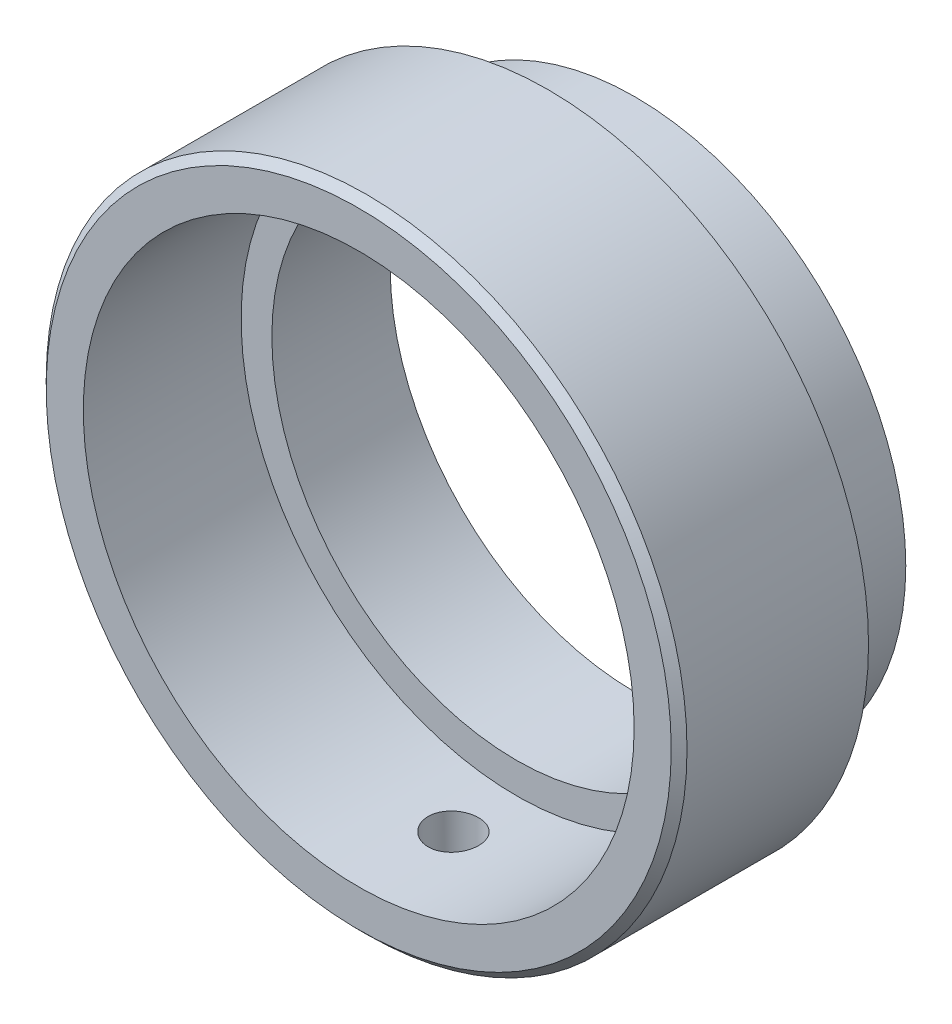
ISO-10303-21;
HEADER;
FILE_DESCRIPTION(('STEP AP214'),'2;1');
FILE_NAME('part.step','',(''),(''),'','','');
FILE_SCHEMA(('AUTOMOTIVE_DESIGN { 1 0 10303 214 1 1 1 1 }'));
ENDSEC;
DATA;
#1=APPLICATION_CONTEXT('core data for automotive mechanical design processes');
#2=APPLICATION_PROTOCOL_DEFINITION('international standard','automotive_design',2000,#1);
#3=PRODUCT_CONTEXT('',#1,'mechanical');
#4=PRODUCT('Part','Part','',(#3));
#5=PRODUCT_RELATED_PRODUCT_CATEGORY('part','',(#4));
#6=PRODUCT_DEFINITION_FORMATION('','',#4);
#7=PRODUCT_DEFINITION_CONTEXT('part definition',#1,'design');
#8=PRODUCT_DEFINITION('design','',#6,#7);
#9=PRODUCT_DEFINITION_SHAPE('','',#8);
#10=(LENGTH_UNIT() NAMED_UNIT(*) SI_UNIT(.MILLI.,.METRE.));
#11=(NAMED_UNIT(*) PLANE_ANGLE_UNIT() SI_UNIT($,.RADIAN.));
#12=(NAMED_UNIT(*) SI_UNIT($,.STERADIAN.) SOLID_ANGLE_UNIT());
#13=UNCERTAINTY_MEASURE_WITH_UNIT(LENGTH_MEASURE(1.E-05),#10,'distance_accuracy_value','');
#14=(GEOMETRIC_REPRESENTATION_CONTEXT(3) GLOBAL_UNCERTAINTY_ASSIGNED_CONTEXT((#13)) GLOBAL_UNIT_ASSIGNED_CONTEXT((#10,
#11,#12)) REPRESENTATION_CONTEXT('',''));
#15=CARTESIAN_POINT('',(0.,0.,0.));
#16=DIRECTION('',(0.,0.,1.));
#17=DIRECTION('',(1.,0.,0.));
#18=AXIS2_PLACEMENT_3D('',#15,#16,#17);
#19=CARTESIAN_POINT('',(0.,0.,0.));
#20=DIRECTION('',(0.,0.,1.));
#21=DIRECTION('',(1.,0.,0.));
#22=AXIS2_PLACEMENT_3D('',#19,#20,#21);
#23=CYLINDRICAL_SURFACE('',#22,15.503861680172);
#24=CARTESIAN_POINT('',(0.,0.,-17.5));
#25=DIRECTION('',(0.,0.,1.));
#26=DIRECTION('',(1.,0.,0.));
#27=AXIS2_PLACEMENT_3D('',#24,#25,#26);
#28=CIRCLE('',#27,15.503861680172);
#29=CARTESIAN_POINT('',(15.503861680172,0.,-17.5));
#30=VERTEX_POINT('',#29);
#31=EDGE_CURVE('E84',#30,#30,#28,.T.);
#32=ORIENTED_EDGE('',*,*,#31,.F.);
#33=EDGE_LOOP('',(#32));
#34=FACE_BOUND('',#33,.T.);
#35=CARTESIAN_POINT('',(0.,0.,-10.));
#36=DIRECTION('',(0.,0.,1.));
#37=DIRECTION('',(1.,0.,0.));
#38=AXIS2_PLACEMENT_3D('',#35,#36,#37);
#39=CIRCLE('',#38,15.503861680172);
#40=CARTESIAN_POINT('',(15.503861680172,0.,-10.));
#41=VERTEX_POINT('',#40);
#42=EDGE_CURVE('E10',#41,#41,#39,.T.);
#43=ORIENTED_EDGE('',*,*,#42,.T.);
#44=EDGE_LOOP('',(#43));
#45=FACE_BOUND('',#44,.T.);
#46=ADVANCED_FACE('F36',(#34,#45),#23,.F.);
#47=CARTESIAN_POINT('',(-17.45,0.,-10.));
#48=DIRECTION('',(0.,0.,-1.));
#49=DIRECTION('',(-1.,0.,0.));
#50=AXIS2_PLACEMENT_3D('',#47,#48,#49);
#51=PLANE('',#50);
#52=ORIENTED_EDGE('',*,*,#42,.F.);
#53=EDGE_LOOP('',(#52));
#54=FACE_BOUND('',#53,.T.);
#55=CARTESIAN_POINT('',(0.,0.,-10.));
#56=DIRECTION('',(0.,0.,1.));
#57=DIRECTION('',(1.,0.,0.));
#58=AXIS2_PLACEMENT_3D('',#55,#56,#57);
#59=CIRCLE('',#58,17.45);
#60=CARTESIAN_POINT('',(17.45,0.,-10.));
#61=VERTEX_POINT('',#60);
#62=EDGE_CURVE('E48',#61,#61,#59,.T.);
#63=ORIENTED_EDGE('',*,*,#62,.T.);
#64=EDGE_LOOP('',(#63));
#65=FACE_BOUND('',#64,.T.);
#66=ADVANCED_FACE('F144',(#54,#65),#51,.F.);
#67=CARTESIAN_POINT('',(0.,0.,0.));
#68=DIRECTION('',(0.,0.,1.));
#69=DIRECTION('',(1.,0.,0.));
#70=AXIS2_PLACEMENT_3D('',#67,#68,#69);
#71=CYLINDRICAL_SURFACE('',#70,17.45);
#72=CARTESIAN_POINT('',(0.,-17.45,-4.4));
#73=CARTESIAN_POINT('',(-0.0896706917262336,-17.4499990460959,-4.40000390111323));
#74=CARTESIAN_POINT('',(-0.179401586220336,-17.4493014539523,-4.40756364877791));
#75=CARTESIAN_POINT('',(-0.356378299918205,-17.4465856957375,-4.43760831431434));
#76=CARTESIAN_POINT('',(-0.443621226971837,-17.4445660533119,-4.46010991839801));
#77=CARTESIAN_POINT('',(-0.613033392366497,-17.4394343052528,-4.51938002171017));
#78=CARTESIAN_POINT('',(-0.695205561910972,-17.4363228378495,-4.55614018736583));
#79=CARTESIAN_POINT('',(-0.852194548686695,-17.42935588628,-4.6428683993269));
#80=CARTESIAN_POINT('',(-0.92701288175583,-17.4255005559329,-4.69283371580364));
#81=CARTESIAN_POINT('',(-1.06741755388352,-17.4174649797443,-4.80471802422666));
#82=CARTESIAN_POINT('',(-1.13297832356848,-17.4132838816578,-4.86666904513362));
#83=CARTESIAN_POINT('',(-1.25278725528329,-17.4050751062729,-5.00069816819159));
#84=CARTESIAN_POINT('',(-1.30703490798846,-17.4010474358886,-5.07277672604721));
#85=CARTESIAN_POINT('',(-1.40276636890143,-17.3935926266026,-5.22517243336541));
#86=CARTESIAN_POINT('',(-1.4442273577091,-17.3901665659858,-5.30550397471456));
#87=CARTESIAN_POINT('',(-1.51306283358703,-17.3843130812233,-5.47202527942643));
#88=CARTESIAN_POINT('',(-1.54043761680325,-17.3818856360831,-5.55821491958635));
#89=CARTESIAN_POINT('',(-1.58024858603582,-17.3783116821519,-5.73374716577616));
#90=CARTESIAN_POINT('',(-1.59272683123933,-17.3771615675637,-5.82308015808688));
#91=CARTESIAN_POINT('',(-1.60252048475482,-17.3762612078239,-6.00257940011381));
#92=CARTESIAN_POINT('',(-1.59983623213108,-17.376510931369,-6.09274563115211));
#93=CARTESIAN_POINT('',(-1.57941579973304,-17.3783787467057,-6.27106282200972));
#94=CARTESIAN_POINT('',(-1.5617254312386,-17.3799926737486,-6.35921907775891));
#95=CARTESIAN_POINT('',(-1.51186615649754,-17.3844005291195,-6.53130590886644));
#96=CARTESIAN_POINT('',(-1.4796970828104,-17.3871944710938,-6.6152364353434));
#97=CARTESIAN_POINT('',(-1.40174261481388,-17.3936523450673,-6.77663471086303));
#98=CARTESIAN_POINT('',(-1.3559367765716,-17.3973175816175,-6.85409253128303));
#99=CARTESIAN_POINT('',(-1.25202375326152,-17.4051039128925,-7.00023804195714));
#100=CARTESIAN_POINT('',(-1.19391626589822,-17.4092250188184,-7.068925516626));
#101=CARTESIAN_POINT('',(-1.06679297493849,-17.4174772900732,-7.19584684205974));
#102=CARTESIAN_POINT('',(-0.997737586376616,-17.4216084361655,-7.25404105348873));
#103=CARTESIAN_POINT('',(-0.850816512697206,-17.4294008425695,-7.35801708958498));
#104=CARTESIAN_POINT('',(-0.772950819929087,-17.4330621024732,-7.40379890347362));
#105=CARTESIAN_POINT('',(-0.610592879605204,-17.4395031434258,-7.48164851964044));
#106=CARTESIAN_POINT('',(-0.526099726485283,-17.4422828037519,-7.513714443928));
#107=CARTESIAN_POINT('',(-0.352897678909723,-17.4466461503246,-7.56319367321369));
#108=CARTESIAN_POINT('',(-0.264188890459779,-17.4482298666273,-7.58060734644924));
#109=CARTESIAN_POINT('',(-0.0854171274265276,-17.4500190256735,-7.60023778297147));
#110=CARTESIAN_POINT('',(0.00463979018220241,-17.4502294317722,-7.60250927308227));
#111=CARTESIAN_POINT('',(0.183853094841297,-17.4492615449215,-7.59193440810838));
#112=CARTESIAN_POINT('',(0.273009492079084,-17.4480832676998,-7.57908822424081));
#113=CARTESIAN_POINT('',(0.447733972817512,-17.4444736587319,-7.53868804752302));
#114=CARTESIAN_POINT('',(0.533307998868746,-17.4420444989113,-7.51115954484439));
#115=CARTESIAN_POINT('',(0.698622989379415,-17.4362058305158,-7.44220227521914));
#116=CARTESIAN_POINT('',(0.778363842946524,-17.4327963033095,-7.40077324409822));
#117=CARTESIAN_POINT('',(0.929997218852568,-17.4253663358282,-7.30505427202099));
#118=CARTESIAN_POINT('',(1.0018668603648,-17.4213441917365,-7.25072821870431));
#119=CARTESIAN_POINT('',(1.13548642107706,-17.413146201484,-7.13080929943877));
#120=CARTESIAN_POINT('',(1.19723612716799,-17.4089703520886,-7.06521619628404));
#121=CARTESIAN_POINT('',(1.30905179376369,-17.4009207845179,-6.92438701260121));
#122=CARTESIAN_POINT('',(1.35908194307638,-17.3970480158625,-6.84912243681924));
#123=CARTESIAN_POINT('',(1.44579247527982,-17.3900570592414,-6.69122800942918));
#124=CARTESIAN_POINT('',(1.48247301529879,-17.3869388623945,-6.60859824452547));
#125=CARTESIAN_POINT('',(1.54138260285803,-17.3818157483741,-6.43844388421113));
#126=CARTESIAN_POINT('',(1.56363327769679,-17.3798091657886,-6.35092682865058));
#127=CARTESIAN_POINT('',(1.59312182092241,-17.3771311089522,-6.17337961548509));
#128=CARTESIAN_POINT('',(1.60036004543937,-17.3764596030303,-6.08334951754668));
#129=CARTESIAN_POINT('',(1.599613716405,-17.3765282962423,-5.9036877461716));
#130=CARTESIAN_POINT('',(1.59168542284159,-17.3772632780332,-5.81405583169116));
#131=CARTESIAN_POINT('',(1.5609487368049,-17.3800510294255,-5.63740259702128));
#132=CARTESIAN_POINT('',(1.53814032428313,-17.3821038008025,-5.55038128034934));
#133=CARTESIAN_POINT('',(1.47830572510731,-17.3872944285645,-5.38141778764914));
#134=CARTESIAN_POINT('',(1.44128086566815,-17.3904321836551,-5.29947513831727));
#135=CARTESIAN_POINT('',(1.35407039129259,-17.3974394293518,-5.14295902031197));
#136=CARTESIAN_POINT('',(1.30388491903721,-17.4013089120247,-5.06838547175837));
#137=CARTESIAN_POINT('',(1.19156628004227,-17.4093607639484,-4.92843619961636));
#138=CARTESIAN_POINT('',(1.12939129236571,-17.4135441961436,-4.86309410091972));
#139=CARTESIAN_POINT('',(0.99493838363238,-17.4217428476449,-4.74374409352162));
#140=CARTESIAN_POINT('',(0.922658033703701,-17.425758026208,-4.68973891753302));
#141=CARTESIAN_POINT('',(0.769878598874282,-17.4331765495474,-4.5945070805041));
#142=CARTESIAN_POINT('',(0.689362002527194,-17.4365785463718,-4.55330843138247));
#143=CARTESIAN_POINT('',(0.522576013690466,-17.4423722164043,-4.48506933152825));
#144=CARTESIAN_POINT('',(0.436313300530067,-17.4447650397468,-4.4580127548964));
#145=CARTESIAN_POINT('',(0.291292816103964,-17.4476627072579,-4.4256477552599));
#146=CARTESIAN_POINT('',(0.233465096377434,-17.4485351555991,-4.41604280105037));
#147=CARTESIAN_POINT('',(0.117100142180567,-17.4497041125022,-4.40321766017645));
#148=CARTESIAN_POINT('',(0.0585629100761802,-17.450000622984,-4.39999745222727));
#149=CARTESIAN_POINT('',(0.,-17.45,-4.4));
#150=B_SPLINE_CURVE_WITH_KNOTS('',3,(#72,#73,#74,#75,#76,#77,#78,#79,#80,#81,#82,#83,#84,#85,
#86,#87,#88,#89,#90,#91,#92,#93,#94,#95,#96,#97,#98,#99,#100,#101,#102,#103,#104,#105,#106,#107,
#108,#109,#110,#111,#112,#113,#114,#115,#116,#117,#118,#119,#120,#121,#122,#123,#124,#125,#126,
#127,#128,#129,#130,#131,#132,#133,#134,#135,#136,#137,#138,#139,#140,#141,#142,#143,#144,#145,
#146,#147,#148,#149),.UNSPECIFIED.,.T.,.F.,(4,2,2,2,2,2,2,2,2,2,2,2,2,2,2,2,2,2,2,2,2,2,2,2,2,2,
2,2,2,2,2,2,2,2,2,2,2,2,4),(0.,0.268798241743992,0.537897167976667,0.806839052801413,
1.07572538416918,1.34534043087774,1.61496761323134,1.88507323113043,2.15517317014353,
2.42450868615312,2.69383817929667,2.96234839932596,3.23086172464991,3.49977964384894,
3.76870417208992,4.03862422635156,4.30854451500462,4.5785017495393,4.8484521993605,
5.11742646376428,5.38639768189548,5.65490344827665,5.92341431779769,6.1926860893101,
6.46196353051223,6.73205336540447,7.00214002116918,7.27182093317399,7.54149544764976,
7.81017154774915,8.07884800984539,8.34749939501933,8.61614786772483,8.88575094835512,
9.15541894113009,9.42567269858821,9.69561761552436,9.87116727879542,10.046716356837),.UNSPECIFIED.);
#151=CARTESIAN_POINT('',(0.,-17.45,-4.4));
#152=VERTEX_POINT('',#151);
#153=EDGE_CURVE('E87',#152,#152,#150,.T.);
#154=ORIENTED_EDGE('',*,*,#153,.T.);
#155=EDGE_LOOP('',(#154));
#156=FACE_BOUND('',#155,.T.);
#157=ORIENTED_EDGE('',*,*,#62,.F.);
#158=EDGE_LOOP('',(#157));
#159=FACE_BOUND('',#158,.T.);
#160=CARTESIAN_POINT('',(0.,0.,0.));
#161=DIRECTION('',(0.,0.,1.));
#162=DIRECTION('',(1.,0.,0.));
#163=AXIS2_PLACEMENT_3D('',#160,#161,#162);
#164=CIRCLE('',#163,17.45);
#165=CARTESIAN_POINT('',(17.45,0.,0.));
#166=VERTEX_POINT('',#165);
#167=EDGE_CURVE('E52',#166,#166,#164,.T.);
#168=ORIENTED_EDGE('',*,*,#167,.T.);
#169=EDGE_LOOP('',(#168));
#170=FACE_BOUND('',#169,.T.);
#171=ADVANCED_FACE('F93',(#156,#159,#170),#71,.F.);
#172=CARTESIAN_POINT('',(-17.45,0.,0.));
#173=DIRECTION('',(0.,0.,-1.));
#174=DIRECTION('',(-1.,0.,0.));
#175=AXIS2_PLACEMENT_3D('',#172,#173,#174);
#176=PLANE('',#175);
#177=ORIENTED_EDGE('',*,*,#167,.F.);
#178=EDGE_LOOP('',(#177));
#179=FACE_BOUND('',#178,.T.);
#180=CARTESIAN_POINT('',(0.,0.,0.));
#181=DIRECTION('',(0.,0.,1.));
#182=DIRECTION('',(1.,0.,0.));
#183=AXIS2_PLACEMENT_3D('',#180,#181,#182);
#184=CIRCLE('',#183,19.8);
#185=CARTESIAN_POINT('',(19.8,0.,0.));
#186=VERTEX_POINT('',#185);
#187=EDGE_CURVE('E57',#186,#186,#184,.T.);
#188=ORIENTED_EDGE('',*,*,#187,.T.);
#189=EDGE_LOOP('',(#188));
#190=FACE_BOUND('',#189,.T.);
#191=ADVANCED_FACE('F136',(#179,#190),#176,.F.);
#192=CARTESIAN_POINT('',(0.,0.,-0.5));
#193=DIRECTION('',(0.,0.,-1.));
#194=DIRECTION('',(-1.,0.,0.));
#195=AXIS2_PLACEMENT_3D('',#192,#193,#194);
#196=CONICAL_SURFACE('',#195,20.3,0.785398163397449);
#197=ORIENTED_EDGE('',*,*,#187,.F.);
#198=EDGE_LOOP('',(#197));
#199=FACE_BOUND('',#198,.T.);
#200=CARTESIAN_POINT('',(0.,0.,-0.5));
#201=DIRECTION('',(0.,0.,1.));
#202=DIRECTION('',(1.,0.,0.));
#203=AXIS2_PLACEMENT_3D('',#200,#201,#202);
#204=CIRCLE('',#203,20.3);
#205=CARTESIAN_POINT('',(20.3,0.,-0.5));
#206=VERTEX_POINT('',#205);
#207=EDGE_CURVE('E60',#206,#206,#204,.T.);
#208=ORIENTED_EDGE('',*,*,#207,.T.);
#209=EDGE_LOOP('',(#208));
#210=FACE_BOUND('',#209,.T.);
#211=ADVANCED_FACE('F133',(#199,#210),#196,.T.);
#212=CARTESIAN_POINT('',(0.,0.,0.));
#213=DIRECTION('',(0.,0.,1.));
#214=DIRECTION('',(1.,0.,0.));
#215=AXIS2_PLACEMENT_3D('',#212,#213,#214);
#216=CYLINDRICAL_SURFACE('',#215,20.3);
#217=CARTESIAN_POINT('',(0.,-20.3,-4.4));
#218=CARTESIAN_POINT('',(0.0897233052871689,-20.2999991709199,-4.40000392625938));
#219=CARTESIAN_POINT('',(0.179508111075815,-20.2993988061207,-4.40757250976189));
#220=CARTESIAN_POINT('',(0.356594763793251,-20.2970615538592,-4.43765432289312));
#221=CARTESIAN_POINT('',(0.443893660620292,-20.29532337034,-4.46018459537914));
#222=CARTESIAN_POINT('',(0.613418016256254,-20.2909069549663,-4.51953528116681));
#223=CARTESIAN_POINT('',(0.695646269565856,-20.2882292464404,-4.5563477402971));
#224=CARTESIAN_POINT('',(0.85273644627675,-20.2822342826047,-4.64320390899048));
#225=CARTESIAN_POINT('',(0.927599967253949,-20.2789171664609,-4.6932447402999));
#226=CARTESIAN_POINT('',(1.0680275703915,-20.2720072470087,-4.80526155345593));
#227=CARTESIAN_POINT('',(1.1335724291288,-20.2684138967131,-4.8672616027137));
#228=CARTESIAN_POINT('',(1.25333728990755,-20.2613611088697,-5.00138624590428));
#229=CARTESIAN_POINT('',(1.30755680045826,-20.2579016771389,-5.07351127900809));
#230=CARTESIAN_POINT('',(1.4031959180732,-20.2515024128471,-5.22595359582664));
#231=CARTESIAN_POINT('',(1.44459879487754,-20.2485632615606,-5.30628140680537));
#232=CARTESIAN_POINT('',(1.5133224723599,-20.2435433987059,-5.47277560646916));
#233=CARTESIAN_POINT('',(1.5406434982065,-20.2414626734115,-5.55894190177201));
#234=CARTESIAN_POINT('',(1.58037259263296,-20.2383997095654,-5.73447576305813));
#235=CARTESIAN_POINT('',(1.59281177649306,-20.2374151793651,-5.82383624598726));
#236=CARTESIAN_POINT('',(1.60252019246274,-20.2366487829144,-6.00338178684815));
#237=CARTESIAN_POINT('',(1.59978968202198,-20.2368668962536,-6.09356683076008));
#238=CARTESIAN_POINT('',(1.57926195549796,-20.2384790651836,-6.27198853504229));
#239=CARTESIAN_POINT('',(1.56149851942621,-20.239870484251,-6.36022910900897));
#240=CARTESIAN_POINT('',(1.51146164104853,-20.2436683415954,-6.53247232604011));
#241=CARTESIAN_POINT('',(1.47918807015551,-20.2460747888674,-6.61647493154086));
#242=CARTESIAN_POINT('',(1.40100910110594,-20.2516345814088,-6.77796555301289));
#243=CARTESIAN_POINT('',(1.35508850689309,-20.2547887584843,-6.85544618264697));
#244=CARTESIAN_POINT('',(1.25092997463092,-20.2614878187263,-7.00161269470898));
#245=CARTESIAN_POINT('',(1.19269181382349,-20.2650327089582,-7.07029841804858));
#246=CARTESIAN_POINT('',(1.06536166283141,-20.2721254853912,-7.19712182434272));
#247=CARTESIAN_POINT('',(0.996240462014963,-20.2756733533302,-7.2552301850139));
#248=CARTESIAN_POINT('',(0.849208353762916,-20.2823630719224,-7.35902279974947));
#249=CARTESIAN_POINT('',(0.771297441234963,-20.2855049223404,-7.40470704661584));
#250=CARTESIAN_POINT('',(0.608878760042293,-20.2910291047555,-7.48235264335567));
#251=CARTESIAN_POINT('',(0.524370389689072,-20.2934113673773,-7.51431273985398));
#252=CARTESIAN_POINT('',(0.35116422749402,-20.2971471300775,-7.56358250432293));
#253=CARTESIAN_POINT('',(0.262466513458427,-20.2985006492542,-7.58089244426951));
#254=CARTESIAN_POINT('',(0.0836536854873675,-20.3000239652522,-7.60033387044716));
#255=CARTESIAN_POINT('',(-0.00645699812781916,-20.3001969213872,-7.60250586777165));
#256=CARTESIAN_POINT('',(-0.185761261100748,-20.299348053167,-7.59171581220314));
#257=CARTESIAN_POINT('',(-0.274954848092359,-20.2983262387651,-7.57875388538725));
#258=CARTESIAN_POINT('',(-0.44977786427812,-20.2952048037067,-7.53809749188448));
#259=CARTESIAN_POINT('',(-0.535411676167585,-20.2931065535366,-7.51042175676243));
#260=CARTESIAN_POINT('',(-0.700819956089837,-20.288068039535,-7.44114246436076));
#261=CARTESIAN_POINT('',(-0.780594340959251,-20.2851277637556,-7.39953870944608));
#262=CARTESIAN_POINT('',(-0.932203904132823,-20.2787271101746,-7.30348223152585));
#263=CARTESIAN_POINT('',(-1.0040219986886,-20.2752656494679,-7.24900261786045));
#264=CARTESIAN_POINT('',(-1.13750799332092,-20.2682153221818,-7.12877981401403));
#265=CARTESIAN_POINT('',(-1.19917573557788,-20.2646264536225,-7.06303644873453));
#266=CARTESIAN_POINT('',(-1.31074905064807,-20.2577164898035,-6.92197680213778));
#267=CARTESIAN_POINT('',(-1.36062822443117,-20.2543960062894,-6.84663960599566));
#268=CARTESIAN_POINT('',(-1.44702761426245,-20.2484072139896,-6.6886351874708));
#269=CARTESIAN_POINT('',(-1.48354795157485,-20.2457388992839,-6.6059680316339));
#270=CARTESIAN_POINT('',(-1.54214783991976,-20.2413598479038,-6.43574449490738));
#271=CARTESIAN_POINT('',(-1.56424366051192,-20.2396480326991,-6.34819374372947));
#272=CARTESIAN_POINT('',(-1.59342030736876,-20.2373720932926,-6.17061090732786));
#273=CARTESIAN_POINT('',(-1.6005013882068,-20.2368079496322,-6.08057886420043));
#274=CARTESIAN_POINT('',(-1.59944474064117,-20.2368914707898,-5.90085149129068));
#275=CARTESIAN_POINT('',(-1.59134849527091,-20.237535832494,-5.81115591316306));
#276=CARTESIAN_POINT('',(-1.56025340088897,-20.2399567467127,-5.63440248655624));
#277=CARTESIAN_POINT('',(-1.53725452796498,-20.2417333010437,-5.54734464230972));
#278=CARTESIAN_POINT('',(-1.4770172887429,-20.2462175660421,-5.37833444893204));
#279=CARTESIAN_POINT('',(-1.43977954555719,-20.248925235962,-5.29638187656972));
#280=CARTESIAN_POINT('',(-1.35212642232192,-20.254966689133,-5.1398850686797));
#281=CARTESIAN_POINT('',(-1.30171128132076,-20.2583004610258,-5.06534069879521));
#282=CARTESIAN_POINT('',(-1.18897884396442,-20.2652292800364,-4.92556429204212));
#283=CARTESIAN_POINT('',(-1.12663093569278,-20.2688249840826,-4.86035697709175));
#284=CARTESIAN_POINT('',(-0.991856181136619,-20.2758665590929,-4.74130769695419));
#285=CARTESIAN_POINT('',(-0.919426893433345,-20.2793123934967,-4.68746849276815));
#286=CARTESIAN_POINT('',(-0.766419788765698,-20.2856715331279,-4.5926195603241));
#287=CARTESIAN_POINT('',(-0.685828262983216,-20.288583918576,-4.55163190586901));
#288=CARTESIAN_POINT('',(-0.518940011309867,-20.2935369411521,-4.48382201821206));
#289=CARTESIAN_POINT('',(-0.432650003688421,-20.2955785843844,-4.45698342787224));
#290=CARTESIAN_POINT('',(-0.288205239720206,-20.2980333263851,-4.42510270025225));
#291=CARTESIAN_POINT('',(-0.2309806361444,-20.2987674908881,-4.41570161720415));
#292=CARTESIAN_POINT('',(-0.115845901506689,-20.2997510948056,-4.40314900673992));
#293=CARTESIAN_POINT('',(-0.0579357720435578,-20.3000005353503,-4.39999746475158));
#294=CARTESIAN_POINT('',(0.,-20.3,-4.4));
#295=B_SPLINE_CURVE_WITH_KNOTS('',3,(#217,#218,#219,#220,#221,#222,#223,#224,#225,#226,#227,
#228,#229,#230,#231,#232,#233,#234,#235,#236,#237,#238,#239,#240,#241,#242,#243,#244,#245,#246,
#247,#248,#249,#250,#251,#252,#253,#254,#255,#256,#257,#258,#259,#260,#261,#262,#263,#264,#265,
#266,#267,#268,#269,#270,#271,#272,#273,#274,#275,#276,#277,#278,#279,#280,#281,#282,#283,#284,
#285,#286,#287,#288,#289,#290,#291,#292,#293,#294),.UNSPECIFIED.,.T.,.F.,(4,2,2,2,2,2,2,2,2,2,2,
2,2,2,2,2,2,2,2,2,2,2,2,2,2,2,2,2,2,2,2,2,2,2,2,2,2,2,4),(0.,0.26895839404993,0.538223685293246,
0.80733922951888,1.07639626721321,1.34600052889002,1.61561648826273,1.88558292243062,
2.15554503970531,2.42494172229818,2.69433383288938,2.9631222034008,3.23191295592974,
3.50100413748516,3.77010018585978,4.03993121689166,4.30976240425203,4.57961822904358,
4.84946904392947,5.11859742486812,5.38772356377854,5.65650790642498,5.92529606321484,
6.19465061140747,6.46400934717938,6.73396568091991,7.00391956408324,7.27356843500617,
7.54321273402359,7.81212110911123,8.08102991568259,8.34992695578428,8.61881911821981,
8.88841056472985,9.15806741245774,9.4281849168611,9.6979894611882,9.87166059925872,
10.0453313323754),.UNSPECIFIED.);
#296=CARTESIAN_POINT('',(0.,-20.3,-4.4));
#297=VERTEX_POINT('',#296);
#298=EDGE_CURVE('E39',#297,#297,#295,.T.);
#299=ORIENTED_EDGE('',*,*,#298,.T.);
#300=EDGE_LOOP('',(#299));
#301=FACE_BOUND('',#300,.T.);
#302=ORIENTED_EDGE('',*,*,#207,.F.);
#303=EDGE_LOOP('',(#302));
#304=FACE_BOUND('',#303,.T.);
#305=CARTESIAN_POINT('',(0.,0.,-12.));
#306=DIRECTION('',(0.,0.,1.));
#307=DIRECTION('',(1.,0.,0.));
#308=AXIS2_PLACEMENT_3D('',#305,#306,#307);
#309=CIRCLE('',#308,20.3);
#310=CARTESIAN_POINT('',(20.3,0.,-12.));
#311=VERTEX_POINT('',#310);
#312=EDGE_CURVE('E63',#311,#311,#309,.T.);
#313=ORIENTED_EDGE('',*,*,#312,.T.);
#314=EDGE_LOOP('',(#313));
#315=FACE_BOUND('',#314,.T.);
#316=ADVANCED_FACE('F128',(#301,#304,#315),#216,.T.);
#317=CARTESIAN_POINT('',(-20.3,0.,-12.));
#318=DIRECTION('',(0.,0.,1.));
#319=DIRECTION('',(1.,0.,0.));
#320=AXIS2_PLACEMENT_3D('',#317,#318,#319);
#321=PLANE('',#320);
#322=ORIENTED_EDGE('',*,*,#312,.F.);
#323=EDGE_LOOP('',(#322));
#324=FACE_BOUND('',#323,.T.);
#325=CARTESIAN_POINT('',(0.,0.,-12.));
#326=DIRECTION('',(0.,0.,1.));
#327=DIRECTION('',(1.,0.,0.));
#328=AXIS2_PLACEMENT_3D('',#325,#326,#327);
#329=CIRCLE('',#328,17.160824742268);
#330=CARTESIAN_POINT('',(17.160824742268,0.,-12.));
#331=VERTEX_POINT('',#330);
#332=EDGE_CURVE('E66',#331,#331,#329,.T.);
#333=ORIENTED_EDGE('',*,*,#332,.T.);
#334=EDGE_LOOP('',(#333));
#335=FACE_BOUND('',#334,.T.);
#336=ADVANCED_FACE('F125',(#324,#335),#321,.F.);
#337=CARTESIAN_POINT('',(0.,0.,0.));
#338=DIRECTION('',(0.,0.,1.));
#339=DIRECTION('',(1.,0.,0.));
#340=AXIS2_PLACEMENT_3D('',#337,#338,#339);
#341=CYLINDRICAL_SURFACE('',#340,17.160824742268);
#342=ORIENTED_EDGE('',*,*,#332,.F.);
#343=EDGE_LOOP('',(#342));
#344=FACE_BOUND('',#343,.T.);
#345=CARTESIAN_POINT('',(0.,0.,-13.5));
#346=DIRECTION('',(0.,0.,1.));
#347=DIRECTION('',(1.,0.,0.));
#348=AXIS2_PLACEMENT_3D('',#345,#346,#347);
#349=CIRCLE('',#348,17.160824742268);
#350=CARTESIAN_POINT('',(17.160824742268,0.,-13.5));
#351=VERTEX_POINT('',#350);
#352=EDGE_CURVE('E69',#351,#351,#349,.T.);
#353=ORIENTED_EDGE('',*,*,#352,.T.);
#354=EDGE_LOOP('',(#353));
#355=FACE_BOUND('',#354,.T.);
#356=ADVANCED_FACE('F121',(#344,#355),#341,.T.);
#357=CARTESIAN_POINT('',(-17.160824742268,0.,-13.5));
#358=DIRECTION('',(0.,0.,1.));
#359=DIRECTION('',(1.,0.,0.));
#360=AXIS2_PLACEMENT_3D('',#357,#358,#359);
#361=PLANE('',#360);
#362=ORIENTED_EDGE('',*,*,#352,.F.);
#363=EDGE_LOOP('',(#362));
#364=FACE_BOUND('',#363,.T.);
#365=CARTESIAN_POINT('',(0.,0.,-13.5));
#366=DIRECTION('',(0.,0.,1.));
#367=DIRECTION('',(1.,0.,0.));
#368=AXIS2_PLACEMENT_3D('',#365,#366,#367);
#369=CIRCLE('',#368,16.760824742268);
#370=CARTESIAN_POINT('',(16.760824742268,0.,-13.5));
#371=VERTEX_POINT('',#370);
#372=EDGE_CURVE('E72',#371,#371,#369,.T.);
#373=ORIENTED_EDGE('',*,*,#372,.T.);
#374=EDGE_LOOP('',(#373));
#375=FACE_BOUND('',#374,.T.);
#376=ADVANCED_FACE('F117',(#364,#375),#361,.F.);
#377=CARTESIAN_POINT('',(0.,0.,0.));
#378=DIRECTION('',(0.,0.,1.));
#379=DIRECTION('',(1.,0.,0.));
#380=AXIS2_PLACEMENT_3D('',#377,#378,#379);
#381=CYLINDRICAL_SURFACE('',#380,16.760824742268);
#382=ORIENTED_EDGE('',*,*,#372,.F.);
#383=EDGE_LOOP('',(#382));
#384=FACE_BOUND('',#383,.T.);
#385=CARTESIAN_POINT('',(0.,0.,-14.));
#386=DIRECTION('',(0.,0.,1.));
#387=DIRECTION('',(1.,0.,0.));
#388=AXIS2_PLACEMENT_3D('',#385,#386,#387);
#389=CIRCLE('',#388,16.760824742268);
#390=CARTESIAN_POINT('',(16.760824742268,0.,-14.));
#391=VERTEX_POINT('',#390);
#392=EDGE_CURVE('E75',#391,#391,#389,.T.);
#393=ORIENTED_EDGE('',*,*,#392,.T.);
#394=EDGE_LOOP('',(#393));
#395=FACE_BOUND('',#394,.T.);
#396=ADVANCED_FACE('F113',(#384,#395),#381,.T.);
#397=CARTESIAN_POINT('',(-16.760824742268,0.,-14.));
#398=DIRECTION('',(0.,0.,-1.));
#399=DIRECTION('',(-1.,0.,0.));
#400=AXIS2_PLACEMENT_3D('',#397,#398,#399);
#401=PLANE('',#400);
#402=ORIENTED_EDGE('',*,*,#392,.F.);
#403=EDGE_LOOP('',(#402));
#404=FACE_BOUND('',#403,.T.);
#405=CARTESIAN_POINT('',(0.,0.,-14.));
#406=DIRECTION('',(0.,0.,1.));
#407=DIRECTION('',(1.,0.,0.));
#408=AXIS2_PLACEMENT_3D('',#405,#406,#407);
#409=CIRCLE('',#408,17.160824742268);
#410=CARTESIAN_POINT('',(17.160824742268,0.,-14.));
#411=VERTEX_POINT('',#410);
#412=EDGE_CURVE('E78',#411,#411,#409,.T.);
#413=ORIENTED_EDGE('',*,*,#412,.T.);
#414=EDGE_LOOP('',(#413));
#415=FACE_BOUND('',#414,.T.);
#416=ADVANCED_FACE('F109',(#404,#415),#401,.F.);
#417=CARTESIAN_POINT('',(0.,0.,0.));
#418=DIRECTION('',(0.,0.,1.));
#419=DIRECTION('',(1.,0.,0.));
#420=AXIS2_PLACEMENT_3D('',#417,#418,#419);
#421=CYLINDRICAL_SURFACE('',#420,17.160824742268);
#422=ORIENTED_EDGE('',*,*,#412,.F.);
#423=EDGE_LOOP('',(#422));
#424=FACE_BOUND('',#423,.T.);
#425=CARTESIAN_POINT('',(0.,0.,-17.5));
#426=DIRECTION('',(0.,0.,1.));
#427=DIRECTION('',(1.,0.,0.));
#428=AXIS2_PLACEMENT_3D('',#425,#426,#427);
#429=CIRCLE('',#428,17.160824742268);
#430=CARTESIAN_POINT('',(17.160824742268,0.,-17.5));
#431=VERTEX_POINT('',#430);
#432=EDGE_CURVE('E81',#431,#431,#429,.T.);
#433=ORIENTED_EDGE('',*,*,#432,.T.);
#434=EDGE_LOOP('',(#433));
#435=FACE_BOUND('',#434,.T.);
#436=ADVANCED_FACE('F105',(#424,#435),#421,.T.);
#437=CARTESIAN_POINT('',(-17.160824742268,0.,-17.5));
#438=DIRECTION('',(0.,0.,1.));
#439=DIRECTION('',(1.,0.,0.));
#440=AXIS2_PLACEMENT_3D('',#437,#438,#439);
#441=PLANE('',#440);
#442=ORIENTED_EDGE('',*,*,#432,.F.);
#443=EDGE_LOOP('',(#442));
#444=FACE_BOUND('',#443,.T.);
#445=ORIENTED_EDGE('',*,*,#31,.T.);
#446=EDGE_LOOP('',(#445));
#447=FACE_BOUND('',#446,.T.);
#448=ADVANCED_FACE('F100',(#444,#447),#441,.F.);
#449=CARTESIAN_POINT('',(0.,-25.,-6.));
#450=DIRECTION('',(0.,1.,0.));
#451=DIRECTION('',(0.,0.,1.));
#452=AXIS2_PLACEMENT_3D('',#449,#450,#451);
#453=CYLINDRICAL_SURFACE('',#452,1.6);
#454=ORIENTED_EDGE('',*,*,#298,.F.);
#455=EDGE_LOOP('',(#454));
#456=FACE_BOUND('',#455,.T.);
#457=ORIENTED_EDGE('',*,*,#153,.F.);
#458=EDGE_LOOP('',(#457));
#459=FACE_BOUND('',#458,.T.);
#460=ADVANCED_FACE('F96',(#456,#459),#453,.F.);
#461=CLOSED_SHELL('',(#46,#66,#171,#191,#211,#316,#336,#356,#376,#396,#416,#436,#448,#460));
#462=MANIFOLD_SOLID_BREP('B2',#461);
#463=ADVANCED_BREP_SHAPE_REPRESENTATION('',(#18,#462),#14);
#464=SHAPE_DEFINITION_REPRESENTATION(#9,#463);
ENDSEC;
END-ISO-10303-21;
